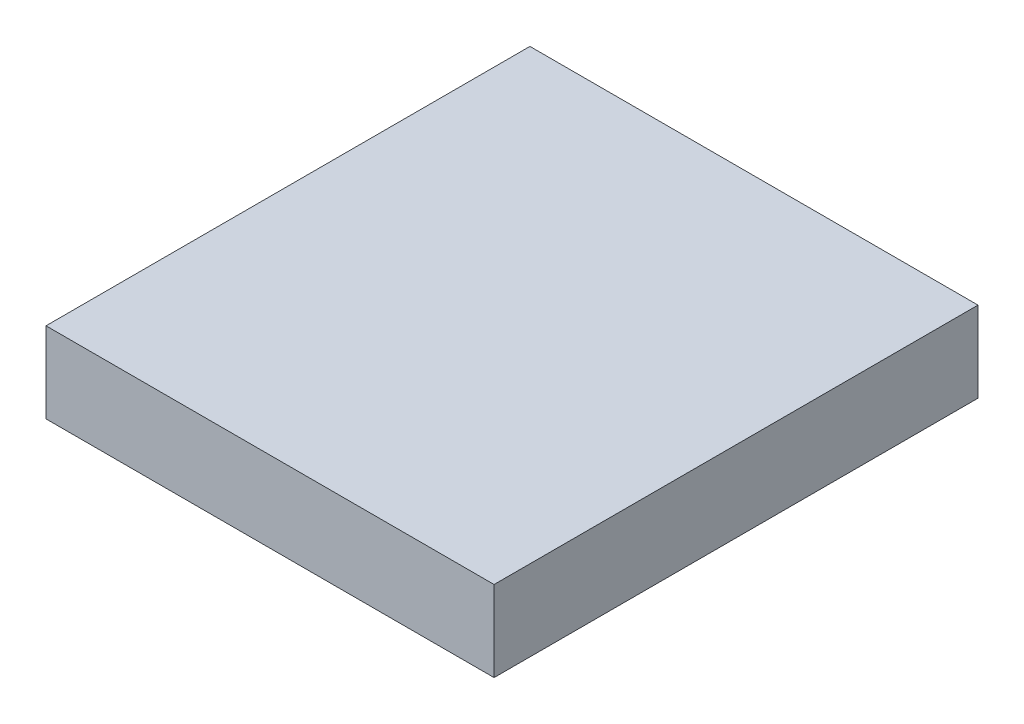
ISO-10303-21;
HEADER;
FILE_DESCRIPTION(('STEP AP214'),'2;1');
FILE_NAME('part.step','',(''),(''),'','','');
FILE_SCHEMA(('AUTOMOTIVE_DESIGN { 1 0 10303 214 1 1 1 1 }'));
ENDSEC;
DATA;
#1=APPLICATION_CONTEXT('core data for automotive mechanical design processes');
#2=APPLICATION_PROTOCOL_DEFINITION('international standard','automotive_design',2000,#1);
#3=PRODUCT_CONTEXT('',#1,'mechanical');
#4=PRODUCT('Part','Part','',(#3));
#5=PRODUCT_RELATED_PRODUCT_CATEGORY('part','',(#4));
#6=PRODUCT_DEFINITION_FORMATION('','',#4);
#7=PRODUCT_DEFINITION_CONTEXT('part definition',#1,'design');
#8=PRODUCT_DEFINITION('design','',#6,#7);
#9=PRODUCT_DEFINITION_SHAPE('','',#8);
#10=(LENGTH_UNIT() NAMED_UNIT(*) SI_UNIT(.MILLI.,.METRE.));
#11=(NAMED_UNIT(*) PLANE_ANGLE_UNIT() SI_UNIT($,.RADIAN.));
#12=(NAMED_UNIT(*) SI_UNIT($,.STERADIAN.) SOLID_ANGLE_UNIT());
#13=UNCERTAINTY_MEASURE_WITH_UNIT(LENGTH_MEASURE(1.E-05),#10,'distance_accuracy_value','');
#14=(GEOMETRIC_REPRESENTATION_CONTEXT(3) GLOBAL_UNCERTAINTY_ASSIGNED_CONTEXT((#13)) GLOBAL_UNIT_ASSIGNED_CONTEXT((#10,
#11,#12)) REPRESENTATION_CONTEXT('',''));
#15=CARTESIAN_POINT('',(0.,0.,0.));
#16=DIRECTION('',(0.,0.,1.));
#17=DIRECTION('',(1.,0.,0.));
#18=AXIS2_PLACEMENT_3D('',#15,#16,#17);
#19=CARTESIAN_POINT('',(1.25000258,0.22497288,0.));
#20=DIRECTION('',(1.01599893403249E-06,-0.999999999999484,0.));
#21=DIRECTION('',(0.999999999999484,1.01599893403249E-06,0.));
#22=AXIS2_PLACEMENT_3D('',#19,#20,#21);
#23=PLANE('',#22);
#24=DIRECTION('',(0.,0.,1.));
#25=VECTOR('',#24,1.);
#26=CARTESIAN_POINT('',(-1.25000004,0.22497034,0.));
#27=LINE('',#26,#25);
#28=CARTESIAN_POINT('',(-1.250000675,0.224970340000001,0.));
#29=VERTEX_POINT('',#28);
#30=CARTESIAN_POINT('',(-1.250000675,0.224970340000001,2.69999968));
#31=VERTEX_POINT('',#30);
#32=EDGE_CURVE('E20',#29,#31,#27,.T.);
#33=ORIENTED_EDGE('',*,*,#32,.T.);
#34=DIRECTION('',(-1.,0.,0.));
#35=VECTOR('',#34,1.);
#36=CARTESIAN_POINT('',(-1.25000258,0.22497034,2.69999968));
#37=LINE('',#36,#35);
#38=CARTESIAN_POINT('',(1.25000258,0.22497161,2.69999968));
#39=VERTEX_POINT('',#38);
#40=EDGE_CURVE('E55',#31,#39,#37,.F.);
#41=ORIENTED_EDGE('',*,*,#40,.T.);
#42=DIRECTION('',(0.,0.,1.));
#43=VECTOR('',#42,1.);
#44=CARTESIAN_POINT('',(1.25000258000001,0.22497288,0.));
#45=LINE('',#44,#43);
#46=CARTESIAN_POINT('',(1.25000258,0.224972245,0.));
#47=VERTEX_POINT('',#46);
#48=EDGE_CURVE('E76',#39,#47,#45,.F.);
#49=ORIENTED_EDGE('',*,*,#48,.T.);
#50=DIRECTION('',(-1.,0.,0.));
#51=VECTOR('',#50,1.);
#52=CARTESIAN_POINT('',(-1.25000258,0.22497034,0.));
#53=LINE('',#52,#51);
#54=EDGE_CURVE('E58',#29,#47,#53,.F.);
#55=ORIENTED_EDGE('',*,*,#54,.F.);
#56=EDGE_LOOP('',(#33,#41,#49,#55));
#57=FACE_BOUND('',#56,.T.);
#58=ADVANCED_FACE('F17',(#57),#23,.F.);
#59=CARTESIAN_POINT('',(-1.25000004,0.22497034,0.));
#60=DIRECTION('',(0.999999999984066,-5.64518859898937E-06,0.));
#61=DIRECTION('',(5.64518859898937E-06,0.999999999984066,0.));
#62=AXIS2_PLACEMENT_3D('',#59,#60,#61);
#63=PLANE('',#62);
#64=DIRECTION('',(0.,0.,1.));
#65=VECTOR('',#64,1.);
#66=CARTESIAN_POINT('',(-1.25000258,-0.22497034,0.));
#67=LINE('',#66,#65);
#68=CARTESIAN_POINT('',(-1.25000258,-0.224969705,0.));
#69=VERTEX_POINT('',#68);
#70=CARTESIAN_POINT('',(-1.25000258,-0.224969705,2.69999968));
#71=VERTEX_POINT('',#70);
#72=EDGE_CURVE('E73',#69,#71,#67,.T.);
#73=ORIENTED_EDGE('',*,*,#72,.T.);
#74=DIRECTION('',(0.,1.,0.));
#75=VECTOR('',#74,1.);
#76=CARTESIAN_POINT('',(-1.25000258,-0.22497034,2.69999968));
#77=LINE('',#76,#75);
#78=EDGE_CURVE('E63',#71,#31,#77,.T.);
#79=ORIENTED_EDGE('',*,*,#78,.T.);
#80=ORIENTED_EDGE('',*,*,#32,.F.);
#81=DIRECTION('',(0.,1.,0.));
#82=VECTOR('',#81,1.);
#83=CARTESIAN_POINT('',(-1.25000258,-0.22497034,0.));
#84=LINE('',#83,#82);
#85=EDGE_CURVE('E78',#69,#29,#84,.T.);
#86=ORIENTED_EDGE('',*,*,#85,.F.);
#87=EDGE_LOOP('',(#73,#79,#80,#86));
#88=FACE_BOUND('',#87,.T.);
#89=ADVANCED_FACE('F72',(#88),#63,.F.);
#90=CARTESIAN_POINT('',(-1.25000258,-0.22497034,2.69999968));
#91=DIRECTION('',(0.,0.,-1.));
#92=DIRECTION('',(-1.,0.,0.));
#93=AXIS2_PLACEMENT_3D('',#90,#91,#92);
#94=PLANE('',#93);
#95=DIRECTION('',(-5.64518863057337E-06,-0.999999999984066,0.));
#96=VECTOR('',#95,1.);
#97=CARTESIAN_POINT('',(1.25000004,-0.2249678,2.69999968));
#98=LINE('',#97,#96);
#99=CARTESIAN_POINT('',(1.25000131,-0.224967800000001,2.69999968));
#100=VERTEX_POINT('',#99);
#101=EDGE_CURVE('E69',#100,#39,#98,.F.);
#102=ORIENTED_EDGE('',*,*,#101,.T.);
#103=ORIENTED_EDGE('',*,*,#40,.F.);
#104=ORIENTED_EDGE('',*,*,#78,.F.);
#105=DIRECTION('',(-0.999999999999484,-1.01599893403249E-06,0.));
#106=VECTOR('',#105,1.);
#107=CARTESIAN_POINT('',(-1.25000258,-0.22497034,2.69999968));
#108=LINE('',#107,#106);
#109=EDGE_CURVE('E83',#71,#100,#108,.F.);
#110=ORIENTED_EDGE('',*,*,#109,.T.);
#111=EDGE_LOOP('',(#102,#103,#104,#110));
#112=FACE_BOUND('',#111,.T.);
#113=ADVANCED_FACE('F66',(#112),#94,.F.);
#114=CARTESIAN_POINT('',(1.25000004,-0.2249678,0.));
#115=DIRECTION('',(-0.999999999984066,5.64518863057337E-06,0.));
#116=DIRECTION('',(-5.64518863057337E-06,-0.999999999984066,0.));
#117=AXIS2_PLACEMENT_3D('',#114,#115,#116);
#118=PLANE('',#117);
#119=ORIENTED_EDGE('',*,*,#48,.F.);
#120=ORIENTED_EDGE('',*,*,#101,.F.);
#121=DIRECTION('',(0.,0.,1.));
#122=VECTOR('',#121,1.);
#123=CARTESIAN_POINT('',(1.25000004,-0.224967800000003,0.));
#124=LINE('',#123,#122);
#125=CARTESIAN_POINT('',(1.250000675,-0.224967800000001,0.));
#126=VERTEX_POINT('',#125);
#127=EDGE_CURVE('E26',#100,#126,#124,.F.);
#128=ORIENTED_EDGE('',*,*,#127,.T.);
#129=DIRECTION('',(0.,1.,0.));
#130=VECTOR('',#129,1.);
#131=CARTESIAN_POINT('',(1.25000258,-0.22497034,0.));
#132=LINE('',#131,#130);
#133=EDGE_CURVE('E34',#47,#126,#132,.F.);
#134=ORIENTED_EDGE('',*,*,#133,.F.);
#135=EDGE_LOOP('',(#119,#120,#128,#134));
#136=FACE_BOUND('',#135,.T.);
#137=ADVANCED_FACE('F88',(#136),#118,.F.);
#138=CARTESIAN_POINT('',(-1.25000258,-0.22497034,0.));
#139=DIRECTION('',(0.,0.,-1.));
#140=DIRECTION('',(-1.,0.,0.));
#141=AXIS2_PLACEMENT_3D('',#138,#139,#140);
#142=PLANE('',#141);
#143=ORIENTED_EDGE('',*,*,#133,.T.);
#144=DIRECTION('',(-0.999999999999484,-1.01599893403249E-06,0.));
#145=VECTOR('',#144,1.);
#146=CARTESIAN_POINT('',(-1.25000258,-0.22497034,0.));
#147=LINE('',#146,#145);
#148=EDGE_CURVE('E11',#126,#69,#147,.T.);
#149=ORIENTED_EDGE('',*,*,#148,.T.);
#150=ORIENTED_EDGE('',*,*,#85,.T.);
#151=ORIENTED_EDGE('',*,*,#54,.T.);
#152=EDGE_LOOP('',(#143,#149,#150,#151));
#153=FACE_BOUND('',#152,.T.);
#154=ADVANCED_FACE('F91',(#153),#142,.T.);
#155=CARTESIAN_POINT('',(-1.25000258,-0.22497034,0.));
#156=DIRECTION('',(-1.01599893403249E-06,0.999999999999484,0.));
#157=DIRECTION('',(-0.999999999999484,-1.01599893403249E-06,0.));
#158=AXIS2_PLACEMENT_3D('',#155,#156,#157);
#159=PLANE('',#158);
#160=ORIENTED_EDGE('',*,*,#127,.F.);
#161=ORIENTED_EDGE('',*,*,#109,.F.);
#162=ORIENTED_EDGE('',*,*,#72,.F.);
#163=ORIENTED_EDGE('',*,*,#148,.F.);
#164=EDGE_LOOP('',(#160,#161,#162,#163));
#165=FACE_BOUND('',#164,.T.);
#166=ADVANCED_FACE('F90',(#165),#159,.F.);
#167=CLOSED_SHELL('',(#58,#89,#113,#137,#154,#166));
#168=MANIFOLD_SOLID_BREP('B1',#167);
#169=ADVANCED_BREP_SHAPE_REPRESENTATION('',(#18,#168),#14);
#170=SHAPE_DEFINITION_REPRESENTATION(#9,#169);
ENDSEC;
END-ISO-10303-21;
